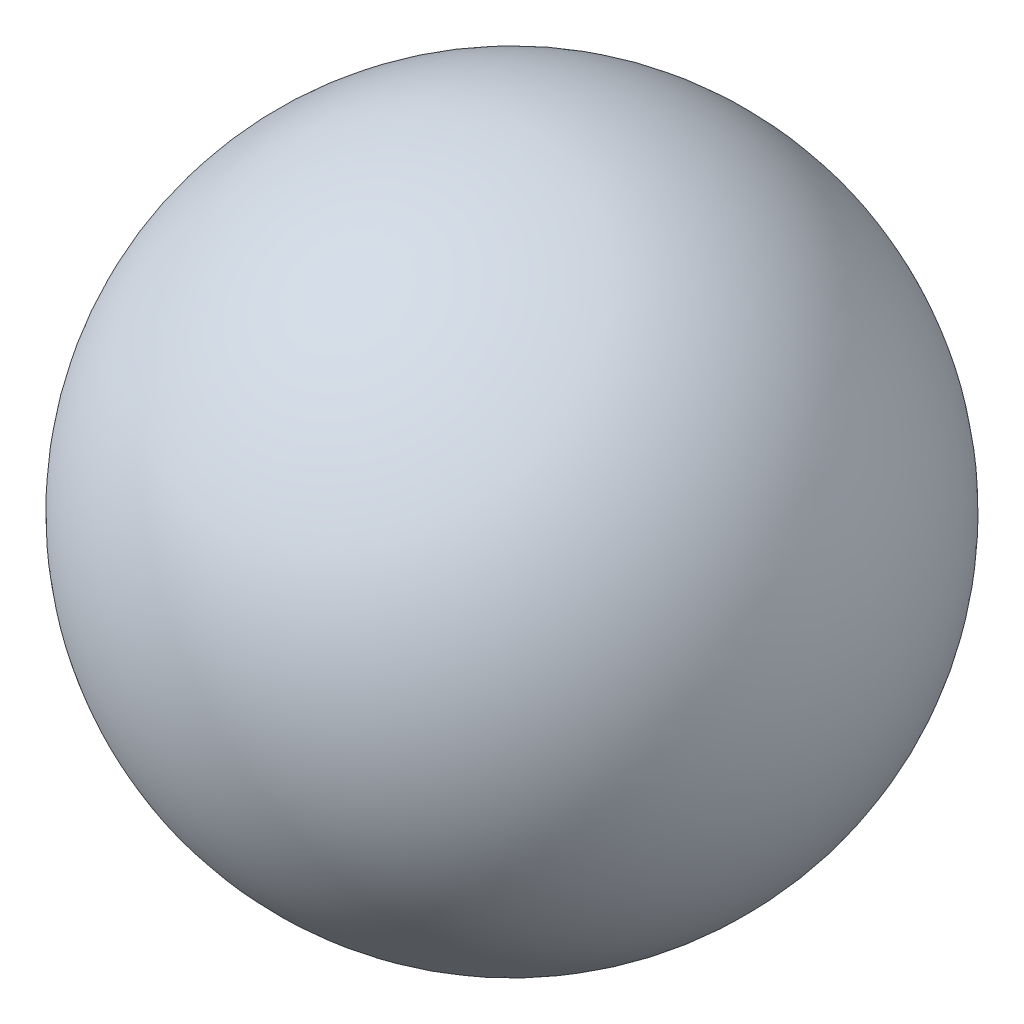
ISO-10303-21;
HEADER;
FILE_DESCRIPTION(('STEP AP214'),'2;1');
FILE_NAME('part.step','',(''),(''),'','','');
FILE_SCHEMA(('AUTOMOTIVE_DESIGN { 1 0 10303 214 1 1 1 1 }'));
ENDSEC;
DATA;
#1=APPLICATION_CONTEXT('core data for automotive mechanical design processes');
#2=APPLICATION_PROTOCOL_DEFINITION('international standard','automotive_design',2000,#1);
#3=PRODUCT_CONTEXT('',#1,'mechanical');
#4=PRODUCT('Part','Part','',(#3));
#5=PRODUCT_RELATED_PRODUCT_CATEGORY('part','',(#4));
#6=PRODUCT_DEFINITION_FORMATION('','',#4);
#7=PRODUCT_DEFINITION_CONTEXT('part definition',#1,'design');
#8=PRODUCT_DEFINITION('design','',#6,#7);
#9=PRODUCT_DEFINITION_SHAPE('','',#8);
#10=(LENGTH_UNIT() NAMED_UNIT(*) SI_UNIT(.MILLI.,.METRE.));
#11=(NAMED_UNIT(*) PLANE_ANGLE_UNIT() SI_UNIT($,.RADIAN.));
#12=(NAMED_UNIT(*) SI_UNIT($,.STERADIAN.) SOLID_ANGLE_UNIT());
#13=UNCERTAINTY_MEASURE_WITH_UNIT(LENGTH_MEASURE(1.E-05),#10,'distance_accuracy_value','');
#14=(GEOMETRIC_REPRESENTATION_CONTEXT(3) GLOBAL_UNCERTAINTY_ASSIGNED_CONTEXT((#13)) GLOBAL_UNIT_ASSIGNED_CONTEXT((#10,
#11,#12)) REPRESENTATION_CONTEXT('',''));
#15=CARTESIAN_POINT('',(0.,0.,0.));
#16=DIRECTION('',(0.,0.,1.));
#17=DIRECTION('',(1.,0.,0.));
#18=AXIS2_PLACEMENT_3D('',#15,#16,#17);
#19=CARTESIAN_POINT('',(0.,0.,0.));
#20=DIRECTION('',(0.,0.,-1.));
#21=DIRECTION('',(1.,0.,0.));
#22=AXIS2_PLACEMENT_3D('',#19,#20,#21);
#23=SPHERICAL_SURFACE('',#22,8.2);
#24=CARTESIAN_POINT('',(0.,0.,-8.2));
#25=VERTEX_POINT('',#24);
#26=VERTEX_LOOP('',#25);
#27=FACE_BOUND('',#26,.T.);
#28=ADVANCED_FACE('F30',(#27),#23,.T.);
#29=CLOSED_SHELL('',(#28));
#30=MANIFOLD_SOLID_BREP('B2',#29);
#31=ADVANCED_BREP_SHAPE_REPRESENTATION('',(#18,#30),#14);
#32=SHAPE_DEFINITION_REPRESENTATION(#9,#31);
ENDSEC;
END-ISO-10303-21;
